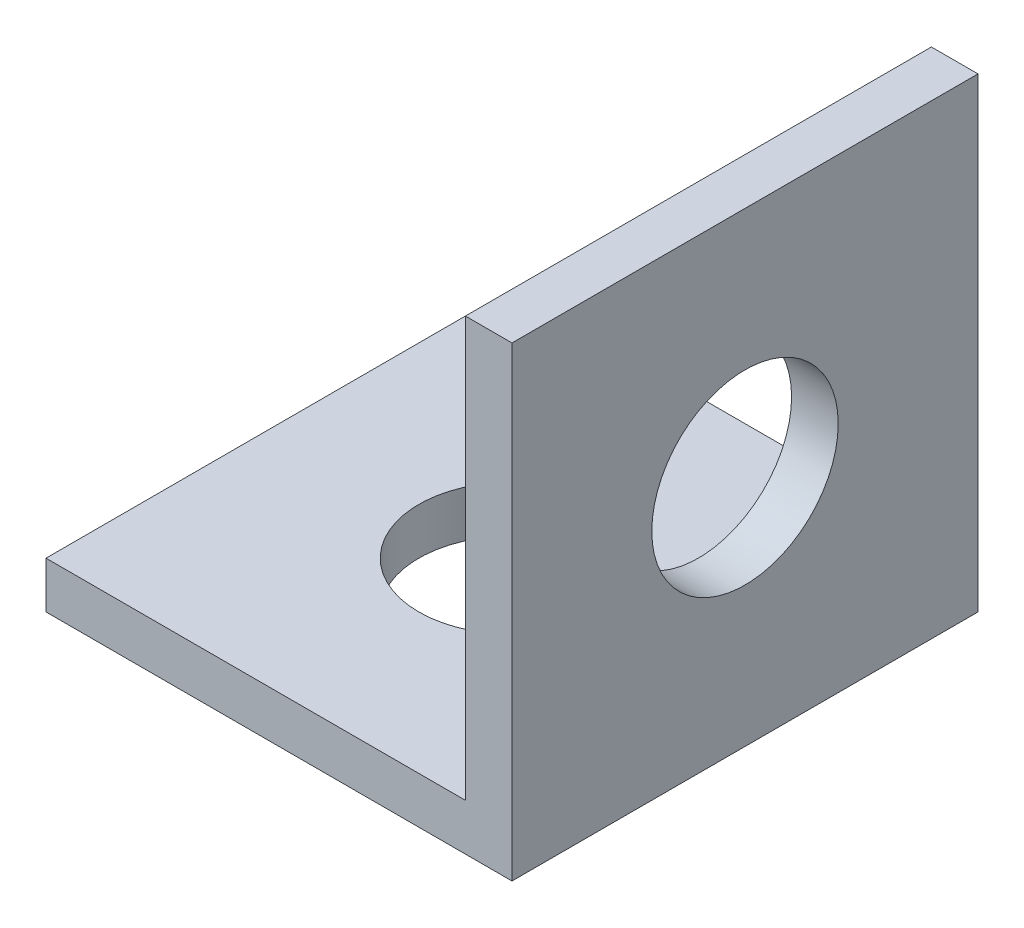
ISO-10303-21;
HEADER;
FILE_DESCRIPTION(('STEP AP214'),'2;1');
FILE_NAME('part.step','',(''),(''),'','','');
FILE_SCHEMA(('AUTOMOTIVE_DESIGN { 1 0 10303 214 1 1 1 1 }'));
ENDSEC;
DATA;
#1=APPLICATION_CONTEXT('core data for automotive mechanical design processes');
#2=APPLICATION_PROTOCOL_DEFINITION('international standard','automotive_design',2000,#1);
#3=PRODUCT_CONTEXT('',#1,'mechanical');
#4=PRODUCT('Part','Part','',(#3));
#5=PRODUCT_RELATED_PRODUCT_CATEGORY('part','',(#4));
#6=PRODUCT_DEFINITION_FORMATION('','',#4);
#7=PRODUCT_DEFINITION_CONTEXT('part definition',#1,'design');
#8=PRODUCT_DEFINITION('design','',#6,#7);
#9=PRODUCT_DEFINITION_SHAPE('','',#8);
#10=(LENGTH_UNIT() NAMED_UNIT(*) SI_UNIT(.MILLI.,.METRE.));
#11=(NAMED_UNIT(*) PLANE_ANGLE_UNIT() SI_UNIT($,.RADIAN.));
#12=(NAMED_UNIT(*) SI_UNIT($,.STERADIAN.) SOLID_ANGLE_UNIT());
#13=UNCERTAINTY_MEASURE_WITH_UNIT(LENGTH_MEASURE(1.E-05),#10,'distance_accuracy_value','');
#14=(GEOMETRIC_REPRESENTATION_CONTEXT(3) GLOBAL_UNCERTAINTY_ASSIGNED_CONTEXT((#13)) GLOBAL_UNIT_ASSIGNED_CONTEXT((#10,
#11,#12)) REPRESENTATION_CONTEXT('',''));
#15=CARTESIAN_POINT('',(0.,0.,0.));
#16=DIRECTION('',(0.,0.,1.));
#17=DIRECTION('',(1.,0.,0.));
#18=AXIS2_PLACEMENT_3D('',#15,#16,#17);
#19=CARTESIAN_POINT('',(0.,1.,-10.));
#20=DIRECTION('',(0.,-1.,0.));
#21=DIRECTION('',(0.,0.,-1.));
#22=AXIS2_PLACEMENT_3D('',#19,#20,#21);
#23=PLANE('',#22);
#24=CARTESIAN_POINT('',(5.,1.,-5.));
#25=DIRECTION('',(0.,1.,0.));
#26=DIRECTION('',(0.,0.,1.));
#27=AXIS2_PLACEMENT_3D('',#24,#25,#26);
#28=CIRCLE('',#27,2.);
#29=CARTESIAN_POINT('',(5.,1.,-3.));
#30=VERTEX_POINT('',#29);
#31=EDGE_CURVE('E95',#30,#30,#28,.T.);
#32=ORIENTED_EDGE('',*,*,#31,.F.);
#33=EDGE_LOOP('',(#32));
#34=FACE_BOUND('',#33,.T.);
#35=DIRECTION('',(0.,0.,1.));
#36=VECTOR('',#35,1.);
#37=CARTESIAN_POINT('',(9.,1.,0.));
#38=LINE('',#37,#36);
#39=CARTESIAN_POINT('',(9.,1.,-10.));
#40=VERTEX_POINT('',#39);
#41=CARTESIAN_POINT('',(9.,1.,0.));
#42=VERTEX_POINT('',#41);
#43=EDGE_CURVE('E48',#40,#42,#38,.T.);
#44=ORIENTED_EDGE('',*,*,#43,.F.);
#45=DIRECTION('',(-1.,0.,0.));
#46=VECTOR('',#45,1.);
#47=CARTESIAN_POINT('',(0.,1.,-10.));
#48=LINE('',#47,#46);
#49=CARTESIAN_POINT('',(0.,1.,-10.));
#50=VERTEX_POINT('',#49);
#51=EDGE_CURVE('E53',#40,#50,#48,.T.);
#52=ORIENTED_EDGE('',*,*,#51,.T.);
#53=DIRECTION('',(0.,0.,1.));
#54=VECTOR('',#53,1.);
#55=CARTESIAN_POINT('',(0.,1.,0.));
#56=LINE('',#55,#54);
#57=CARTESIAN_POINT('',(0.,1.,0.));
#58=VERTEX_POINT('',#57);
#59=EDGE_CURVE('E84',#50,#58,#56,.T.);
#60=ORIENTED_EDGE('',*,*,#59,.T.);
#61=DIRECTION('',(1.,0.,0.));
#62=VECTOR('',#61,1.);
#63=CARTESIAN_POINT('',(0.,1.,0.));
#64=LINE('',#63,#62);
#65=EDGE_CURVE('E109',#58,#42,#64,.T.);
#66=ORIENTED_EDGE('',*,*,#65,.T.);
#67=EDGE_LOOP('',(#44,#52,#60,#66));
#68=FACE_BOUND('',#67,.T.);
#69=ADVANCED_FACE('F31',(#34,#68),#23,.F.);
#70=CARTESIAN_POINT('',(0.,0.,-10.));
#71=DIRECTION('',(0.,-1.,0.));
#72=DIRECTION('',(0.,0.,-1.));
#73=AXIS2_PLACEMENT_3D('',#70,#71,#72);
#74=PLANE('',#73);
#75=DIRECTION('',(0.,0.,1.));
#76=VECTOR('',#75,1.);
#77=CARTESIAN_POINT('',(0.,0.,0.));
#78=LINE('',#77,#76);
#79=CARTESIAN_POINT('',(0.,0.,-10.));
#80=VERTEX_POINT('',#79);
#81=CARTESIAN_POINT('',(0.,0.,0.));
#82=VERTEX_POINT('',#81);
#83=EDGE_CURVE('E90',#80,#82,#78,.T.);
#84=ORIENTED_EDGE('',*,*,#83,.F.);
#85=DIRECTION('',(-1.,0.,0.));
#86=VECTOR('',#85,1.);
#87=CARTESIAN_POINT('',(0.,0.,-10.));
#88=LINE('',#87,#86);
#89=CARTESIAN_POINT('',(10.,0.,-10.));
#90=VERTEX_POINT('',#89);
#91=EDGE_CURVE('E73',#90,#80,#88,.T.);
#92=ORIENTED_EDGE('',*,*,#91,.F.);
#93=DIRECTION('',(0.,0.,-1.));
#94=VECTOR('',#93,1.);
#95=CARTESIAN_POINT('',(10.,0.,0.));
#96=LINE('',#95,#94);
#97=CARTESIAN_POINT('',(10.,0.,0.));
#98=VERTEX_POINT('',#97);
#99=EDGE_CURVE('E85',#98,#90,#96,.T.);
#100=ORIENTED_EDGE('',*,*,#99,.F.);
#101=DIRECTION('',(1.,0.,0.));
#102=VECTOR('',#101,1.);
#103=CARTESIAN_POINT('',(0.,0.,0.));
#104=LINE('',#103,#102);
#105=EDGE_CURVE('E94',#82,#98,#104,.T.);
#106=ORIENTED_EDGE('',*,*,#105,.F.);
#107=EDGE_LOOP('',(#84,#92,#100,#106));
#108=FACE_BOUND('',#107,.T.);
#109=CARTESIAN_POINT('',(5.,0.,-5.));
#110=DIRECTION('',(0.,1.,0.));
#111=DIRECTION('',(0.,0.,1.));
#112=AXIS2_PLACEMENT_3D('',#109,#110,#111);
#113=CIRCLE('',#112,2.);
#114=CARTESIAN_POINT('',(5.,0.,-3.));
#115=VERTEX_POINT('',#114);
#116=EDGE_CURVE('E99',#115,#115,#113,.T.);
#117=ORIENTED_EDGE('',*,*,#116,.T.);
#118=EDGE_LOOP('',(#117));
#119=FACE_BOUND('',#118,.T.);
#120=ADVANCED_FACE('F92',(#108,#119),#74,.T.);
#121=CARTESIAN_POINT('',(0.,1.,0.));
#122=DIRECTION('',(1.,0.,0.));
#123=DIRECTION('',(0.,0.,-1.));
#124=AXIS2_PLACEMENT_3D('',#121,#122,#123);
#125=PLANE('',#124);
#126=ORIENTED_EDGE('',*,*,#83,.T.);
#127=DIRECTION('',(0.,-1.,0.));
#128=VECTOR('',#127,1.);
#129=CARTESIAN_POINT('',(0.,1.,0.));
#130=LINE('',#129,#128);
#131=EDGE_CURVE('E11',#58,#82,#130,.T.);
#132=ORIENTED_EDGE('',*,*,#131,.F.);
#133=ORIENTED_EDGE('',*,*,#59,.F.);
#134=DIRECTION('',(0.,-1.,0.));
#135=VECTOR('',#134,1.);
#136=CARTESIAN_POINT('',(0.,1.,-10.));
#137=LINE('',#136,#135);
#138=EDGE_CURVE('E76',#50,#80,#137,.T.);
#139=ORIENTED_EDGE('',*,*,#138,.T.);
#140=EDGE_LOOP('',(#126,#132,#133,#139));
#141=FACE_BOUND('',#140,.T.);
#142=ADVANCED_FACE('F33',(#141),#125,.F.);
#143=CARTESIAN_POINT('',(0.,1.,0.));
#144=DIRECTION('',(0.,0.,-1.));
#145=DIRECTION('',(-1.,0.,0.));
#146=AXIS2_PLACEMENT_3D('',#143,#144,#145);
#147=PLANE('',#146);
#148=ORIENTED_EDGE('',*,*,#105,.T.);
#149=DIRECTION('',(0.,-1.,0.));
#150=VECTOR('',#149,1.);
#151=CARTESIAN_POINT('',(10.,1.,0.));
#152=LINE('',#151,#150);
#153=CARTESIAN_POINT('',(10.,10.,0.));
#154=VERTEX_POINT('',#153);
#155=EDGE_CURVE('E40',#154,#98,#152,.T.);
#156=ORIENTED_EDGE('',*,*,#155,.F.);
#157=DIRECTION('',(1.,0.,0.));
#158=VECTOR('',#157,1.);
#159=CARTESIAN_POINT('',(10.,10.,0.));
#160=LINE('',#159,#158);
#161=CARTESIAN_POINT('',(9.,10.,0.));
#162=VERTEX_POINT('',#161);
#163=EDGE_CURVE('E120',#162,#154,#160,.T.);
#164=ORIENTED_EDGE('',*,*,#163,.F.);
#165=DIRECTION('',(0.,-1.,0.));
#166=VECTOR('',#165,1.);
#167=CARTESIAN_POINT('',(9.,10.,0.));
#168=LINE('',#167,#166);
#169=EDGE_CURVE('E125',#162,#42,#168,.T.);
#170=ORIENTED_EDGE('',*,*,#169,.T.);
#171=ORIENTED_EDGE('',*,*,#65,.F.);
#172=ORIENTED_EDGE('',*,*,#131,.T.);
#173=EDGE_LOOP('',(#148,#156,#164,#170,#171,#172));
#174=FACE_BOUND('',#173,.T.);
#175=ADVANCED_FACE('F151',(#174),#147,.F.);
#176=CARTESIAN_POINT('',(10.,1.,0.));
#177=DIRECTION('',(-1.,0.,0.));
#178=DIRECTION('',(0.,0.,1.));
#179=AXIS2_PLACEMENT_3D('',#176,#177,#178);
#180=PLANE('',#179);
#181=CARTESIAN_POINT('',(10.,5.,-5.));
#182=DIRECTION('',(1.,0.,0.));
#183=DIRECTION('',(0.,0.,-1.));
#184=AXIS2_PLACEMENT_3D('',#181,#182,#183);
#185=CIRCLE('',#184,2.);
#186=CARTESIAN_POINT('',(10.,5.,-7.));
#187=VERTEX_POINT('',#186);
#188=EDGE_CURVE('E160',#187,#187,#185,.T.);
#189=ORIENTED_EDGE('',*,*,#188,.F.);
#190=EDGE_LOOP('',(#189));
#191=FACE_BOUND('',#190,.T.);
#192=ORIENTED_EDGE('',*,*,#99,.T.);
#193=DIRECTION('',(0.,-1.,0.));
#194=VECTOR('',#193,1.);
#195=CARTESIAN_POINT('',(10.,1.,-10.));
#196=LINE('',#195,#194);
#197=CARTESIAN_POINT('',(10.,10.,-10.));
#198=VERTEX_POINT('',#197);
#199=EDGE_CURVE('E80',#198,#90,#196,.T.);
#200=ORIENTED_EDGE('',*,*,#199,.F.);
#201=DIRECTION('',(0.,0.,-1.));
#202=VECTOR('',#201,1.);
#203=CARTESIAN_POINT('',(10.,10.,0.));
#204=LINE('',#203,#202);
#205=EDGE_CURVE('E123',#154,#198,#204,.T.);
#206=ORIENTED_EDGE('',*,*,#205,.F.);
#207=ORIENTED_EDGE('',*,*,#155,.T.);
#208=EDGE_LOOP('',(#192,#200,#206,#207));
#209=FACE_BOUND('',#208,.T.);
#210=ADVANCED_FACE('F167',(#191,#209),#180,.F.);
#211=CARTESIAN_POINT('',(0.,1.,-10.));
#212=DIRECTION('',(0.,0.,1.));
#213=DIRECTION('',(1.,0.,0.));
#214=AXIS2_PLACEMENT_3D('',#211,#212,#213);
#215=PLANE('',#214);
#216=ORIENTED_EDGE('',*,*,#91,.T.);
#217=ORIENTED_EDGE('',*,*,#138,.F.);
#218=ORIENTED_EDGE('',*,*,#51,.F.);
#219=DIRECTION('',(0.,-1.,0.));
#220=VECTOR('',#219,1.);
#221=CARTESIAN_POINT('',(9.,10.,-10.));
#222=LINE('',#221,#220);
#223=CARTESIAN_POINT('',(9.,10.,-10.));
#224=VERTEX_POINT('',#223);
#225=EDGE_CURVE('E116',#224,#40,#222,.T.);
#226=ORIENTED_EDGE('',*,*,#225,.F.);
#227=DIRECTION('',(-1.,0.,0.));
#228=VECTOR('',#227,1.);
#229=CARTESIAN_POINT('',(10.,10.,-10.));
#230=LINE('',#229,#228);
#231=EDGE_CURVE('E141',#198,#224,#230,.T.);
#232=ORIENTED_EDGE('',*,*,#231,.F.);
#233=ORIENTED_EDGE('',*,*,#199,.T.);
#234=EDGE_LOOP('',(#216,#217,#218,#226,#232,#233));
#235=FACE_BOUND('',#234,.T.);
#236=ADVANCED_FACE('F75',(#235),#215,.F.);
#237=CARTESIAN_POINT('',(5.,1.,-5.));
#238=DIRECTION('',(0.,-1.,0.));
#239=DIRECTION('',(0.,0.,-1.));
#240=AXIS2_PLACEMENT_3D('',#237,#238,#239);
#241=CYLINDRICAL_SURFACE('',#240,2.);
#242=ORIENTED_EDGE('',*,*,#31,.T.);
#243=EDGE_LOOP('',(#242));
#244=FACE_BOUND('',#243,.T.);
#245=ORIENTED_EDGE('',*,*,#116,.F.);
#246=EDGE_LOOP('',(#245));
#247=FACE_BOUND('',#246,.T.);
#248=ADVANCED_FACE('F179',(#244,#247),#241,.F.);
#249=CARTESIAN_POINT('',(9.,10.,0.));
#250=DIRECTION('',(1.,0.,0.));
#251=DIRECTION('',(0.,0.,-1.));
#252=AXIS2_PLACEMENT_3D('',#249,#250,#251);
#253=PLANE('',#252);
#254=CARTESIAN_POINT('',(9.,5.,-5.));
#255=DIRECTION('',(1.,0.,0.));
#256=DIRECTION('',(0.,0.,-1.));
#257=AXIS2_PLACEMENT_3D('',#254,#255,#256);
#258=CIRCLE('',#257,2.);
#259=CARTESIAN_POINT('',(9.,5.,-7.));
#260=VERTEX_POINT('',#259);
#261=EDGE_CURVE('E124',#260,#260,#258,.F.);
#262=ORIENTED_EDGE('',*,*,#261,.F.);
#263=EDGE_LOOP('',(#262));
#264=FACE_BOUND('',#263,.T.);
#265=ORIENTED_EDGE('',*,*,#43,.T.);
#266=ORIENTED_EDGE('',*,*,#169,.F.);
#267=DIRECTION('',(0.,0.,1.));
#268=VECTOR('',#267,1.);
#269=CARTESIAN_POINT('',(9.,10.,0.));
#270=LINE('',#269,#268);
#271=EDGE_CURVE('E138',#224,#162,#270,.T.);
#272=ORIENTED_EDGE('',*,*,#271,.F.);
#273=ORIENTED_EDGE('',*,*,#225,.T.);
#274=EDGE_LOOP('',(#265,#266,#272,#273));
#275=FACE_BOUND('',#274,.T.);
#276=ADVANCED_FACE('F133',(#264,#275),#253,.F.);
#277=CARTESIAN_POINT('',(10.,10.,-10.));
#278=DIRECTION('',(0.,1.,0.));
#279=DIRECTION('',(0.,0.,1.));
#280=AXIS2_PLACEMENT_3D('',#277,#278,#279);
#281=PLANE('',#280);
#282=ORIENTED_EDGE('',*,*,#205,.T.);
#283=ORIENTED_EDGE('',*,*,#231,.T.);
#284=ORIENTED_EDGE('',*,*,#271,.T.);
#285=ORIENTED_EDGE('',*,*,#163,.T.);
#286=EDGE_LOOP('',(#282,#283,#284,#285));
#287=FACE_BOUND('',#286,.T.);
#288=ADVANCED_FACE('F171',(#287),#281,.T.);
#289=CARTESIAN_POINT('',(-0.00102499999999998,5.,-5.));
#290=DIRECTION('',(1.,0.,0.));
#291=DIRECTION('',(0.,0.,-1.));
#292=AXIS2_PLACEMENT_3D('',#289,#290,#291);
#293=CYLINDRICAL_SURFACE('',#292,2.);
#294=ORIENTED_EDGE('',*,*,#188,.T.);
#295=EDGE_LOOP('',(#294));
#296=FACE_BOUND('',#295,.T.);
#297=ORIENTED_EDGE('',*,*,#261,.T.);
#298=EDGE_LOOP('',(#297));
#299=FACE_BOUND('',#298,.T.);
#300=ADVANCED_FACE('F164',(#296,#299),#293,.F.);
#301=CLOSED_SHELL('',(#69,#120,#142,#175,#210,#236,#248,#276,#288,#300));
#302=MANIFOLD_SOLID_BREP('B2',#301);
#303=ADVANCED_BREP_SHAPE_REPRESENTATION('',(#18,#302),#14);
#304=SHAPE_DEFINITION_REPRESENTATION(#9,#303);
ENDSEC;
END-ISO-10303-21;
